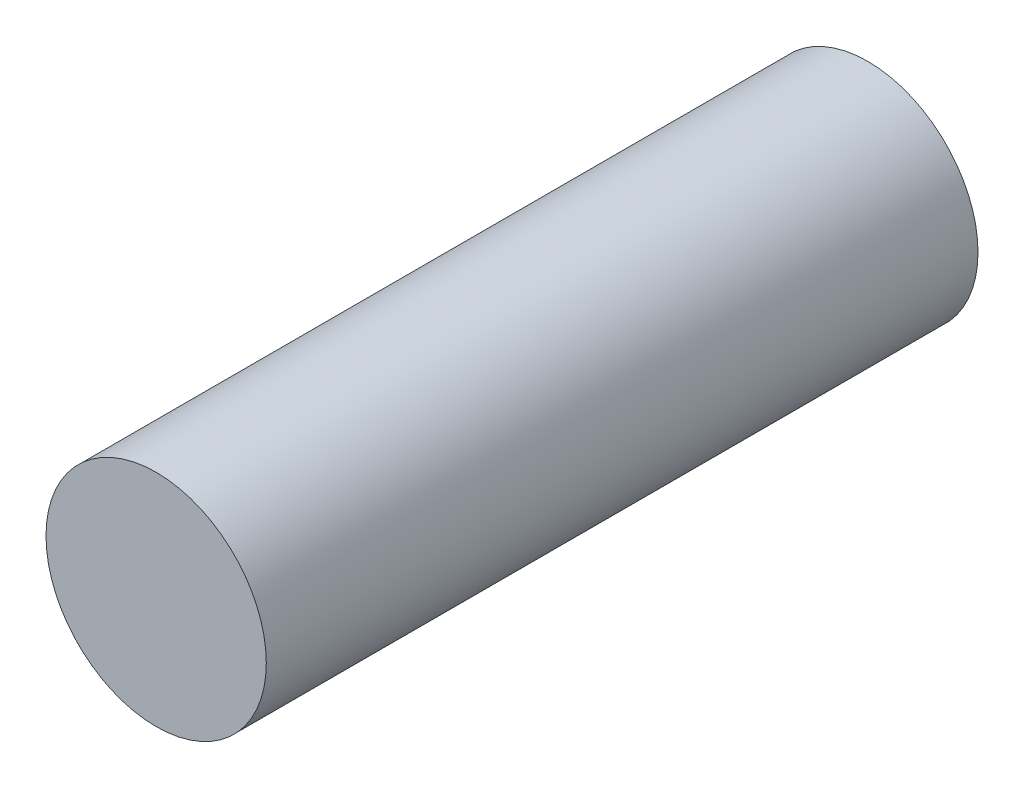
ISO-10303-21;
HEADER;
FILE_DESCRIPTION(('STEP AP214'),'2;1');
FILE_NAME('part.step','',(''),(''),'','','');
FILE_SCHEMA(('AUTOMOTIVE_DESIGN { 1 0 10303 214 1 1 1 1 }'));
ENDSEC;
DATA;
#1=APPLICATION_CONTEXT('core data for automotive mechanical design processes');
#2=APPLICATION_PROTOCOL_DEFINITION('international standard','automotive_design',2000,#1);
#3=PRODUCT_CONTEXT('',#1,'mechanical');
#4=PRODUCT('Part','Part','',(#3));
#5=PRODUCT_RELATED_PRODUCT_CATEGORY('part','',(#4));
#6=PRODUCT_DEFINITION_FORMATION('','',#4);
#7=PRODUCT_DEFINITION_CONTEXT('part definition',#1,'design');
#8=PRODUCT_DEFINITION('design','',#6,#7);
#9=PRODUCT_DEFINITION_SHAPE('','',#8);
#10=(LENGTH_UNIT() NAMED_UNIT(*) SI_UNIT(.MILLI.,.METRE.));
#11=(NAMED_UNIT(*) PLANE_ANGLE_UNIT() SI_UNIT($,.RADIAN.));
#12=(NAMED_UNIT(*) SI_UNIT($,.STERADIAN.) SOLID_ANGLE_UNIT());
#13=UNCERTAINTY_MEASURE_WITH_UNIT(LENGTH_MEASURE(1.E-05),#10,'distance_accuracy_value','');
#14=(GEOMETRIC_REPRESENTATION_CONTEXT(3) GLOBAL_UNCERTAINTY_ASSIGNED_CONTEXT((#13)) GLOBAL_UNIT_ASSIGNED_CONTEXT((#10,
#11,#12)) REPRESENTATION_CONTEXT('',''));
#15=CARTESIAN_POINT('',(0.,0.,0.));
#16=DIRECTION('',(0.,0.,1.));
#17=DIRECTION('',(1.,0.,0.));
#18=AXIS2_PLACEMENT_3D('',#15,#16,#17);
#19=CARTESIAN_POINT('',(0.,0.,52.5));
#20=DIRECTION('',(0.,0.,-1.));
#21=DIRECTION('',(-1.,0.,0.));
#22=AXIS2_PLACEMENT_3D('',#19,#20,#21);
#23=PLANE('',#22);
#24=CARTESIAN_POINT('',(0.,0.,52.5));
#25=DIRECTION('',(0.,0.,1.));
#26=DIRECTION('',(1.,0.,0.));
#27=AXIS2_PLACEMENT_3D('',#24,#25,#26);
#28=CIRCLE('',#27,16.25);
#29=CARTESIAN_POINT('',(16.25,0.,52.5));
#30=VERTEX_POINT('',#29);
#31=EDGE_CURVE('E10',#30,#30,#28,.T.);
#32=ORIENTED_EDGE('',*,*,#31,.T.);
#33=EDGE_LOOP('',(#32));
#34=FACE_BOUND('',#33,.T.);
#35=ADVANCED_FACE('F35',(#34),#23,.F.);
#36=CARTESIAN_POINT('',(0.,0.,0.));
#37=DIRECTION('',(0.,0.,1.));
#38=DIRECTION('',(1.,0.,0.));
#39=AXIS2_PLACEMENT_3D('',#36,#37,#38);
#40=CYLINDRICAL_SURFACE('',#39,16.25);
#41=ORIENTED_EDGE('',*,*,#31,.F.);
#42=EDGE_LOOP('',(#41));
#43=FACE_BOUND('',#42,.T.);
#44=CARTESIAN_POINT('',(0.,0.,-52.5));
#45=DIRECTION('',(0.,0.,1.));
#46=DIRECTION('',(1.,0.,0.));
#47=AXIS2_PLACEMENT_3D('',#44,#45,#46);
#48=CIRCLE('',#47,16.25);
#49=CARTESIAN_POINT('',(16.25,0.,-52.5));
#50=VERTEX_POINT('',#49);
#51=EDGE_CURVE('E41',#50,#50,#48,.T.);
#52=ORIENTED_EDGE('',*,*,#51,.T.);
#53=EDGE_LOOP('',(#52));
#54=FACE_BOUND('',#53,.T.);
#55=ADVANCED_FACE('F47',(#43,#54),#40,.T.);
#56=CARTESIAN_POINT('',(0.,0.,-52.5));
#57=DIRECTION('',(0.,0.,1.));
#58=DIRECTION('',(1.,0.,0.));
#59=AXIS2_PLACEMENT_3D('',#56,#57,#58);
#60=PLANE('',#59);
#61=ORIENTED_EDGE('',*,*,#51,.F.);
#62=EDGE_LOOP('',(#61));
#63=FACE_BOUND('',#62,.T.);
#64=ADVANCED_FACE('F49',(#63),#60,.F.);
#65=CLOSED_SHELL('',(#35,#55,#64));
#66=MANIFOLD_SOLID_BREP('B2',#65);
#67=ADVANCED_BREP_SHAPE_REPRESENTATION('',(#18,#66),#14);
#68=SHAPE_DEFINITION_REPRESENTATION(#9,#67);
ENDSEC;
END-ISO-10303-21;
